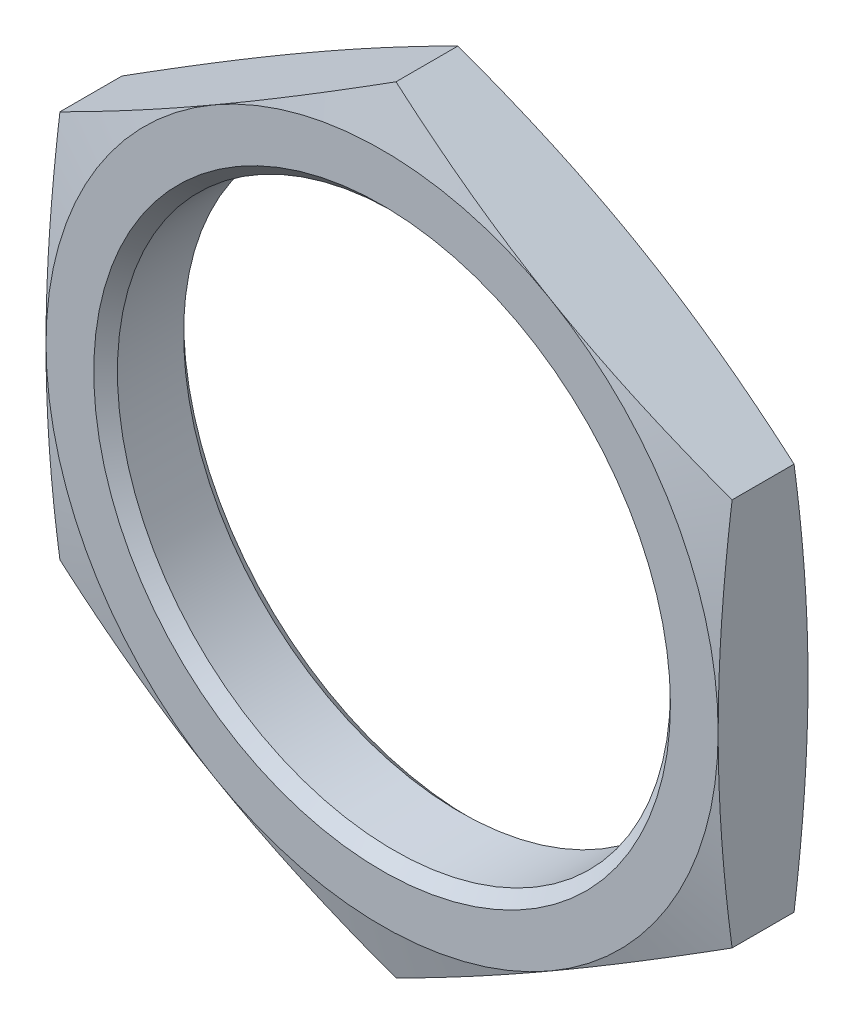
ISO-10303-21;
HEADER;
FILE_DESCRIPTION(('STEP AP214'),'2;1');
FILE_NAME('part.step','',(''),(''),'','','');
FILE_SCHEMA(('AUTOMOTIVE_DESIGN { 1 0 10303 214 1 1 1 1 }'));
ENDSEC;
DATA;
#1=APPLICATION_CONTEXT('core data for automotive mechanical design processes');
#2=APPLICATION_PROTOCOL_DEFINITION('international standard','automotive_design',2000,#1);
#3=PRODUCT_CONTEXT('',#1,'mechanical');
#4=PRODUCT('Part','Part','',(#3));
#5=PRODUCT_RELATED_PRODUCT_CATEGORY('part','',(#4));
#6=PRODUCT_DEFINITION_FORMATION('','',#4);
#7=PRODUCT_DEFINITION_CONTEXT('part definition',#1,'design');
#8=PRODUCT_DEFINITION('design','',#6,#7);
#9=PRODUCT_DEFINITION_SHAPE('','',#8);
#10=(LENGTH_UNIT() NAMED_UNIT(*) SI_UNIT(.MILLI.,.METRE.));
#11=(NAMED_UNIT(*) PLANE_ANGLE_UNIT() SI_UNIT($,.RADIAN.));
#12=(NAMED_UNIT(*) SI_UNIT($,.STERADIAN.) SOLID_ANGLE_UNIT());
#13=UNCERTAINTY_MEASURE_WITH_UNIT(LENGTH_MEASURE(1.E-05),#10,'distance_accuracy_value','');
#14=(GEOMETRIC_REPRESENTATION_CONTEXT(3) GLOBAL_UNCERTAINTY_ASSIGNED_CONTEXT((#13)) GLOBAL_UNIT_ASSIGNED_CONTEXT((#10,
#11,#12)) REPRESENTATION_CONTEXT('',''));
#15=CARTESIAN_POINT('',(0.,0.,0.));
#16=DIRECTION('',(0.,0.,1.));
#17=DIRECTION('',(1.,0.,0.));
#18=AXIS2_PLACEMENT_3D('',#15,#16,#17);
#19=CARTESIAN_POINT('',(0.,0.,-0.95));
#20=DIRECTION('',(0.,0.,-1.));
#21=DIRECTION('',(0.,-1.,0.));
#22=AXIS2_PLACEMENT_3D('',#19,#20,#21);
#23=PLANE('',#22);
#24=CARTESIAN_POINT('',(0.,0.,-0.95));
#25=DIRECTION('',(0.,0.,-1.));
#26=DIRECTION('',(1.,0.,0.));
#27=AXIS2_PLACEMENT_3D('',#24,#25,#26);
#28=CIRCLE('',#27,7.11);
#29=CARTESIAN_POINT('',(7.11,0.,-0.95));
#30=VERTEX_POINT('',#29);
#31=CARTESIAN_POINT('',(3.555,-6.157440620907,-0.95));
#32=VERTEX_POINT('',#31);
#33=EDGE_CURVE('E397',#30,#32,#28,.T.);
#34=ORIENTED_EDGE('',*,*,#33,.T.);
#35=CARTESIAN_POINT('',(0.,0.,-0.95));
#36=DIRECTION('',(0.,0.,-1.));
#37=DIRECTION('',(1.,0.,0.));
#38=AXIS2_PLACEMENT_3D('',#35,#36,#37);
#39=CIRCLE('',#38,7.11);
#40=CARTESIAN_POINT('',(-3.555,-6.157440620907,-0.95));
#41=VERTEX_POINT('',#40);
#42=EDGE_CURVE('E445',#32,#41,#39,.T.);
#43=ORIENTED_EDGE('',*,*,#42,.T.);
#44=CARTESIAN_POINT('',(0.,0.,-0.95));
#45=DIRECTION('',(0.,0.,-1.));
#46=DIRECTION('',(1.,0.,0.));
#47=AXIS2_PLACEMENT_3D('',#44,#45,#46);
#48=CIRCLE('',#47,7.11);
#49=CARTESIAN_POINT('',(-7.11,2.06476548E-07,-0.95));
#50=VERTEX_POINT('',#49);
#51=EDGE_CURVE('E449',#41,#50,#48,.T.);
#52=ORIENTED_EDGE('',*,*,#51,.T.);
#53=CARTESIAN_POINT('',(0.,0.,-0.95));
#54=DIRECTION('',(0.,0.,-1.));
#55=DIRECTION('',(1.,0.,0.));
#56=AXIS2_PLACEMENT_3D('',#53,#54,#55);
#57=CIRCLE('',#56,7.11);
#58=CARTESIAN_POINT('',(-3.555,6.157440620907,-0.95));
#59=VERTEX_POINT('',#58);
#60=EDGE_CURVE('E25',#50,#59,#57,.T.);
#61=ORIENTED_EDGE('',*,*,#60,.T.);
#62=CARTESIAN_POINT('',(0.,0.,-0.95));
#63=DIRECTION('',(0.,0.,-1.));
#64=DIRECTION('',(1.,0.,0.));
#65=AXIS2_PLACEMENT_3D('',#62,#63,#64);
#66=CIRCLE('',#65,7.11);
#67=CARTESIAN_POINT('',(3.555,6.157440620907,-0.95));
#68=VERTEX_POINT('',#67);
#69=EDGE_CURVE('E11',#59,#68,#66,.T.);
#70=ORIENTED_EDGE('',*,*,#69,.T.);
#71=CARTESIAN_POINT('',(0.,0.,-0.95));
#72=DIRECTION('',(0.,0.,-1.));
#73=DIRECTION('',(1.,0.,0.));
#74=AXIS2_PLACEMENT_3D('',#71,#72,#73);
#75=CIRCLE('',#74,7.11);
#76=EDGE_CURVE('E391',#68,#30,#75,.T.);
#77=ORIENTED_EDGE('',*,*,#76,.T.);
#78=EDGE_LOOP('',(#34,#43,#52,#61,#70,#77));
#79=FACE_BOUND('',#78,.T.);
#80=CARTESIAN_POINT('',(0.,0.,-0.95));
#81=DIRECTION('',(0.,0.,-1.));
#82=DIRECTION('',(1.,0.,0.));
#83=AXIS2_PLACEMENT_3D('',#80,#81,#82);
#84=CIRCLE('',#83,6.1);
#85=CARTESIAN_POINT('',(6.1,0.,-0.95));
#86=VERTEX_POINT('',#85);
#87=EDGE_CURVE('E331',#86,#86,#84,.T.);
#88=ORIENTED_EDGE('',*,*,#87,.F.);
#89=EDGE_LOOP('',(#88));
#90=FACE_BOUND('',#89,.T.);
#91=ADVANCED_FACE('F17',(#79,#90),#23,.T.);
#92=CARTESIAN_POINT('',(0.,0.,0.));
#93=DIRECTION('',(0.,0.,1.));
#94=DIRECTION('',(1.,0.,0.));
#95=AXIS2_PLACEMENT_3D('',#92,#93,#94);
#96=CONICAL_SURFACE('',#95,10.655448267188,1.308996938996);
#97=CARTESIAN_POINT('',(5.95523630408934E-13,8.20992082787682,-0.655277102432029));
#98=CARTESIAN_POINT('',(1.90511875818563,7.10999999999992,-0.95));
#99=CARTESIAN_POINT('',(3.555,6.157440620907,-0.95));
#100=(BOUNDED_CURVE() B_SPLINE_CURVE(2,(#97,#98,#99),.UNSPECIFIED.,.F.,
.F.) B_SPLINE_CURVE_WITH_KNOTS((3,3),(0.,1.),
.UNSPECIFIED.) CURVE() GEOMETRIC_REPRESENTATION_ITEM() RATIONAL_B_SPLINE_CURVE((1.,
1.03795484930204,1.)) REPRESENTATION_ITEM(''));
#101=CARTESIAN_POINT('',(0.,8.209920827876,-0.655277102432));
#102=VERTEX_POINT('',#101);
#103=EDGE_CURVE('E334',#102,#68,#100,.T.);
#104=ORIENTED_EDGE('',*,*,#103,.T.);
#105=ORIENTED_EDGE('',*,*,#69,.F.);
#106=CARTESIAN_POINT('',(-3.555,6.157440620907,-0.95));
#107=CARTESIAN_POINT('',(-1.90511875818559,7.10999999999996,-0.95));
#108=CARTESIAN_POINT('',(-4.71178651650916E-13,8.20992082787689,-0.655277102432009));
#109=(BOUNDED_CURVE() B_SPLINE_CURVE(2,(#106,#107,#108),.UNSPECIFIED.,.F.,
.F.) B_SPLINE_CURVE_WITH_KNOTS((3,3),(0.,1.),
.UNSPECIFIED.) CURVE() GEOMETRIC_REPRESENTATION_ITEM() RATIONAL_B_SPLINE_CURVE((1.,
1.03795484930206,1.)) REPRESENTATION_ITEM(''));
#110=EDGE_CURVE('E206',#59,#102,#109,.T.);
#111=ORIENTED_EDGE('',*,*,#110,.T.);
#112=EDGE_LOOP('',(#104,#105,#111));
#113=FACE_BOUND('',#112,.T.);
#114=ADVANCED_FACE('F463',(#113),#96,.T.);
#115=CARTESIAN_POINT('',(0.,0.,0.));
#116=DIRECTION('',(0.,0.,1.));
#117=DIRECTION('',(1.,0.,0.));
#118=AXIS2_PLACEMENT_3D('',#115,#116,#117);
#119=CONICAL_SURFACE('',#118,10.655448267188,1.308996938996);
#120=CARTESIAN_POINT('',(-7.10999999999942,4.10496041393718,-0.655277102432026));
#121=CARTESIAN_POINT('',(-5.20488124181438,5.20488124181408,-0.950000000000001));
#122=CARTESIAN_POINT('',(-3.555,6.157440620907,-0.95));
#123=(BOUNDED_CURVE() B_SPLINE_CURVE(2,(#120,#121,#122),.UNSPECIFIED.,.F.,
.F.) B_SPLINE_CURVE_WITH_KNOTS((3,3),(0.,1.),
.UNSPECIFIED.) CURVE() GEOMETRIC_REPRESENTATION_ITEM() RATIONAL_B_SPLINE_CURVE((1.,
1.03795484930208,1.)) REPRESENTATION_ITEM(''));
#124=CARTESIAN_POINT('',(-7.11,4.104960413938,-0.655277102432));
#125=VERTEX_POINT('',#124);
#126=EDGE_CURVE('E259',#125,#59,#123,.T.);
#127=ORIENTED_EDGE('',*,*,#126,.T.);
#128=ORIENTED_EDGE('',*,*,#60,.F.);
#129=CARTESIAN_POINT('',(-7.11,2.06476544361227E-07,-0.95));
#130=CARTESIAN_POINT('',(-7.11,1.90511886883588,-0.949999985175651));
#131=CARTESIAN_POINT('',(-7.11,4.10496041393862,-0.655277102432165));
#132=(BOUNDED_CURVE() B_SPLINE_CURVE(2,(#129,#130,#131),.UNSPECIFIED.,.F.,
.F.) B_SPLINE_CURVE_WITH_KNOTS((3,3),(0.,1.),
.UNSPECIFIED.) CURVE() GEOMETRIC_REPRESENTATION_ITEM() RATIONAL_B_SPLINE_CURVE((1.,
1.03795484526372,1.)) REPRESENTATION_ITEM(''));
#133=EDGE_CURVE('E240',#50,#125,#132,.T.);
#134=ORIENTED_EDGE('',*,*,#133,.T.);
#135=EDGE_LOOP('',(#127,#128,#134));
#136=FACE_BOUND('',#135,.T.);
#137=ADVANCED_FACE('F457',(#136),#119,.T.);
#138=CARTESIAN_POINT('',(0.,0.,0.));
#139=DIRECTION('',(0.,0.,1.));
#140=DIRECTION('',(1.,0.,0.));
#141=AXIS2_PLACEMENT_3D('',#138,#139,#140);
#142=CONICAL_SURFACE('',#141,10.655448267188,1.308996938996);
#143=ORIENTED_EDGE('',*,*,#51,.F.);
#144=CARTESIAN_POINT('',(-3.555,-6.157440620907,-0.95));
#145=CARTESIAN_POINT('',(-5.20488124181442,-5.20488124181405,-0.950000000000001));
#146=CARTESIAN_POINT('',(-7.10999999999953,-4.10496041393711,-0.655277102432009));
#147=(BOUNDED_CURVE() B_SPLINE_CURVE(2,(#144,#145,#146),.UNSPECIFIED.,.F.,
.F.) B_SPLINE_CURVE_WITH_KNOTS((3,3),(0.,1.),
.UNSPECIFIED.) CURVE() GEOMETRIC_REPRESENTATION_ITEM() RATIONAL_B_SPLINE_CURVE((1.,
1.03795484930205,1.)) REPRESENTATION_ITEM(''));
#148=CARTESIAN_POINT('',(-7.11,-4.104960413938,-0.655277102432));
#149=VERTEX_POINT('',#148);
#150=EDGE_CURVE('E384',#41,#149,#147,.T.);
#151=ORIENTED_EDGE('',*,*,#150,.T.);
#152=CARTESIAN_POINT('',(-7.11,-4.10496041393616,-0.655277102432491));
#153=CARTESIAN_POINT('',(-7.11,-1.905118647534,-0.950000014824347));
#154=CARTESIAN_POINT('',(-7.11,2.06476544361227E-07,-0.95));
#155=(BOUNDED_CURVE() B_SPLINE_CURVE(2,(#152,#153,#154),.UNSPECIFIED.,.F.,
.F.) B_SPLINE_CURVE_WITH_KNOTS((3,3),(0.,1.),
.UNSPECIFIED.) CURVE() GEOMETRIC_REPRESENTATION_ITEM() RATIONAL_B_SPLINE_CURVE((1.,
1.03795485334035,1.)) REPRESENTATION_ITEM(''));
#156=EDGE_CURVE('E207',#149,#50,#155,.T.);
#157=ORIENTED_EDGE('',*,*,#156,.T.);
#158=EDGE_LOOP('',(#143,#151,#157));
#159=FACE_BOUND('',#158,.T.);
#160=ADVANCED_FACE('F482',(#159),#142,.T.);
#161=CARTESIAN_POINT('',(0.,0.,0.));
#162=DIRECTION('',(0.,0.,1.));
#163=DIRECTION('',(1.,0.,0.));
#164=AXIS2_PLACEMENT_3D('',#161,#162,#163);
#165=CONICAL_SURFACE('',#164,10.655448267188,1.308996938996);
#166=ORIENTED_EDGE('',*,*,#42,.F.);
#167=CARTESIAN_POINT('',(3.555,-6.157440620907,-0.95));
#168=CARTESIAN_POINT('',(1.90511875818559,-7.10999999999995,-0.95));
#169=CARTESIAN_POINT('',(4.73843186910017E-13,-8.20992082787689,-0.655277102432009));
#170=(BOUNDED_CURVE() B_SPLINE_CURVE(2,(#167,#168,#169),.UNSPECIFIED.,.F.,
.F.) B_SPLINE_CURVE_WITH_KNOTS((3,3),(0.,1.),
.UNSPECIFIED.) CURVE() GEOMETRIC_REPRESENTATION_ITEM() RATIONAL_B_SPLINE_CURVE((1.,
1.03795484930205,1.)) REPRESENTATION_ITEM(''));
#171=CARTESIAN_POINT('',(0.,-8.209920827876,-0.655277102432));
#172=VERTEX_POINT('',#171);
#173=EDGE_CURVE('E362',#32,#172,#170,.T.);
#174=ORIENTED_EDGE('',*,*,#173,.T.);
#175=CARTESIAN_POINT('',(-5.87974113841483E-13,-8.20992082787682,-0.655277102432026));
#176=CARTESIAN_POINT('',(-1.90511875818563,-7.10999999999993,-0.950000000000001));
#177=CARTESIAN_POINT('',(-3.555,-6.157440620907,-0.95));
#178=(BOUNDED_CURVE() B_SPLINE_CURVE(2,(#175,#176,#177),.UNSPECIFIED.,.F.,
.F.) B_SPLINE_CURVE_WITH_KNOTS((3,3),(0.,1.),
.UNSPECIFIED.) CURVE() GEOMETRIC_REPRESENTATION_ITEM() RATIONAL_B_SPLINE_CURVE((1.,
1.03795484930208,1.)) REPRESENTATION_ITEM(''));
#179=EDGE_CURVE('E390',#172,#41,#178,.T.);
#180=ORIENTED_EDGE('',*,*,#179,.T.);
#181=EDGE_LOOP('',(#166,#174,#180));
#182=FACE_BOUND('',#181,.T.);
#183=ADVANCED_FACE('F476',(#182),#165,.T.);
#184=CARTESIAN_POINT('',(0.,0.,0.));
#185=DIRECTION('',(0.,0.,1.));
#186=DIRECTION('',(1.,0.,0.));
#187=AXIS2_PLACEMENT_3D('',#184,#185,#186);
#188=CONICAL_SURFACE('',#187,10.655448267188,1.308996938996);
#189=ORIENTED_EDGE('',*,*,#33,.F.);
#190=CARTESIAN_POINT('',(7.11,0.,-0.95));
#191=CARTESIAN_POINT('',(7.11000000000001,-1.90511875818543,-0.95));
#192=CARTESIAN_POINT('',(7.11,-4.10496041393861,-0.655277102432164));
#193=(BOUNDED_CURVE() B_SPLINE_CURVE(2,(#190,#191,#192),.UNSPECIFIED.,.F.,
.F.) B_SPLINE_CURVE_WITH_KNOTS((3,3),(0.,1.),
.UNSPECIFIED.) CURVE() GEOMETRIC_REPRESENTATION_ITEM() RATIONAL_B_SPLINE_CURVE((1.,
1.03795484930205,1.)) REPRESENTATION_ITEM(''));
#194=CARTESIAN_POINT('',(7.11,-4.104960413938,-0.655277102432));
#195=VERTEX_POINT('',#194);
#196=EDGE_CURVE('E337',#30,#195,#193,.T.);
#197=ORIENTED_EDGE('',*,*,#196,.T.);
#198=CARTESIAN_POINT('',(7.10999999999941,-4.10496041393718,-0.655277102432028));
#199=CARTESIAN_POINT('',(5.20488124181437,-5.20488124181408,-0.95));
#200=CARTESIAN_POINT('',(3.555,-6.157440620907,-0.95));
#201=(BOUNDED_CURVE() B_SPLINE_CURVE(2,(#198,#199,#200),.UNSPECIFIED.,.F.,
.F.) B_SPLINE_CURVE_WITH_KNOTS((3,3),(0.,1.),
.UNSPECIFIED.) CURVE() GEOMETRIC_REPRESENTATION_ITEM() RATIONAL_B_SPLINE_CURVE((1.,
1.03795484930206,1.)) REPRESENTATION_ITEM(''));
#202=EDGE_CURVE('E368',#195,#32,#201,.T.);
#203=ORIENTED_EDGE('',*,*,#202,.T.);
#204=EDGE_LOOP('',(#189,#197,#203));
#205=FACE_BOUND('',#204,.T.);
#206=ADVANCED_FACE('F474',(#205),#188,.T.);
#207=CARTESIAN_POINT('',(0.,0.,0.));
#208=DIRECTION('',(0.,0.,1.));
#209=DIRECTION('',(1.,0.,0.));
#210=AXIS2_PLACEMENT_3D('',#207,#208,#209);
#211=CONICAL_SURFACE('',#210,10.655448267188,1.308996938996);
#212=CARTESIAN_POINT('',(7.11,4.10496041393615,-0.655277102432495));
#213=CARTESIAN_POINT('',(7.11,1.90511875818445,-0.950000000000001));
#214=CARTESIAN_POINT('',(7.11,0.,-0.95));
#215=(BOUNDED_CURVE() B_SPLINE_CURVE(2,(#212,#213,#214),.UNSPECIFIED.,.F.,
.F.) B_SPLINE_CURVE_WITH_KNOTS((3,3),(0.,1.),
.UNSPECIFIED.) CURVE() GEOMETRIC_REPRESENTATION_ITEM() RATIONAL_B_SPLINE_CURVE((1.,
1.03795484930199,1.)) REPRESENTATION_ITEM(''));
#216=CARTESIAN_POINT('',(7.11,4.104960413938,-0.655277102432));
#217=VERTEX_POINT('',#216);
#218=EDGE_CURVE('E343',#217,#30,#215,.T.);
#219=ORIENTED_EDGE('',*,*,#218,.T.);
#220=ORIENTED_EDGE('',*,*,#76,.F.);
#221=CARTESIAN_POINT('',(3.555,6.157440620907,-0.95));
#222=CARTESIAN_POINT('',(5.20488124181442,5.20488124181405,-0.95));
#223=CARTESIAN_POINT('',(7.10999999999953,4.10496041393711,-0.655277102432009));
#224=(BOUNDED_CURVE() B_SPLINE_CURVE(2,(#221,#222,#223),.UNSPECIFIED.,.F.,
.F.) B_SPLINE_CURVE_WITH_KNOTS((3,3),(0.,1.),
.UNSPECIFIED.) CURVE() GEOMETRIC_REPRESENTATION_ITEM() RATIONAL_B_SPLINE_CURVE((1.,
1.03795484930206,1.)) REPRESENTATION_ITEM(''));
#225=EDGE_CURVE('E268',#68,#217,#224,.T.);
#226=ORIENTED_EDGE('',*,*,#225,.T.);
#227=EDGE_LOOP('',(#219,#220,#226));
#228=FACE_BOUND('',#227,.T.);
#229=ADVANCED_FACE('F470',(#228),#211,.T.);
#230=CARTESIAN_POINT('',(0.,0.,-0.7));
#231=DIRECTION('',(0.,0.,-1.));
#232=DIRECTION('',(1.,0.,0.));
#233=AXIS2_PLACEMENT_3D('',#230,#231,#232);
#234=CONICAL_SURFACE('',#233,5.85,0.785398163397);
#235=ORIENTED_EDGE('',*,*,#87,.T.);
#236=DIRECTION('',(0.707106781186548,0.,-0.707106781186548));
#237=VECTOR('',#236,1.);
#238=CARTESIAN_POINT('',(5.85,0.,-0.7));
#239=LINE('',#238,#237);
#240=CARTESIAN_POINT('',(5.85,0.,-0.7));
#241=VERTEX_POINT('',#240);
#242=EDGE_CURVE('E37',#241,#86,#239,.T.);
#243=ORIENTED_EDGE('',*,*,#242,.F.);
#244=CARTESIAN_POINT('',(0.,0.,-0.7));
#245=DIRECTION('',(0.,0.,-1.));
#246=DIRECTION('',(1.,0.,0.));
#247=AXIS2_PLACEMENT_3D('',#244,#245,#246);
#248=CIRCLE('',#247,5.85);
#249=EDGE_CURVE('E327',#241,#241,#248,.T.);
#250=ORIENTED_EDGE('',*,*,#249,.F.);
#251=ORIENTED_EDGE('',*,*,#242,.T.);
#252=EDGE_LOOP('',(#235,#243,#250,#251));
#253=FACE_BOUND('',#252,.T.);
#254=ADVANCED_FACE('F535',(#253),#234,.F.);
#255=CARTESIAN_POINT('',(7.11,4.104960413938,0.95));
#256=DIRECTION('',(0.50000000000019,0.866025403784329,0.));
#257=DIRECTION('',(0.,0.,-1.));
#258=AXIS2_PLACEMENT_3D('',#255,#256,#257);
#259=PLANE('',#258);
#260=CARTESIAN_POINT('',(7.10999999999941,4.10496041393718,0.655277102432028));
#261=CARTESIAN_POINT('',(5.20488124959185,5.20488123732375,0.94999999879682));
#262=CARTESIAN_POINT('',(3.55500001451297,6.15744061252794,0.95));
#263=(BOUNDED_CURVE() B_SPLINE_CURVE(2,(#260,#261,#262),.UNSPECIFIED.,.F.,
.F.) B_SPLINE_CURVE_WITH_KNOTS((3,3),(0.,1.),
.UNSPECIFIED.) CURVE() GEOMETRIC_REPRESENTATION_ITEM() RATIONAL_B_SPLINE_CURVE((1.,
1.03795484897429,1.)) REPRESENTATION_ITEM(''));
#264=CARTESIAN_POINT('',(7.11,4.104960413938,0.655277102432));
#265=VERTEX_POINT('',#264);
#266=CARTESIAN_POINT('',(3.555000014513,6.157440612528,0.95));
#267=VERTEX_POINT('',#266);
#268=EDGE_CURVE('E313',#265,#267,#263,.T.);
#269=ORIENTED_EDGE('',*,*,#268,.F.);
#270=DIRECTION('',(0.,0.,-1.));
#271=VECTOR('',#270,1.);
#272=CARTESIAN_POINT('',(7.11,4.104960413938,0.95));
#273=LINE('',#272,#271);
#274=EDGE_CURVE('E352',#265,#217,#273,.T.);
#275=ORIENTED_EDGE('',*,*,#274,.T.);
#276=ORIENTED_EDGE('',*,*,#225,.F.);
#277=ORIENTED_EDGE('',*,*,#103,.F.);
#278=DIRECTION('',(0.,0.,-1.));
#279=VECTOR('',#278,1.);
#280=CARTESIAN_POINT('',(0.,8.209920827876,0.95));
#281=LINE('',#280,#279);
#282=CARTESIAN_POINT('',(0.,8.209920827876,0.655277102432));
#283=VERTEX_POINT('',#282);
#284=EDGE_CURVE('E204',#283,#102,#281,.T.);
#285=ORIENTED_EDGE('',*,*,#284,.F.);
#286=CARTESIAN_POINT('',(3.55500001451297,6.15744061252794,0.95));
#287=CARTESIAN_POINT('',(1.90511876596306,7.10999999550963,0.95000000120318));
#288=CARTESIAN_POINT('',(4.76063632959267E-13,8.20992082787688,0.655277102432009));
#289=(BOUNDED_CURVE() B_SPLINE_CURVE(2,(#286,#287,#288),.UNSPECIFIED.,.F.,
.F.) B_SPLINE_CURVE_WITH_KNOTS((3,3),(0.,1.),
.UNSPECIFIED.) CURVE() GEOMETRIC_REPRESENTATION_ITEM() RATIONAL_B_SPLINE_CURVE((1.,
1.03795484962984,1.)) REPRESENTATION_ITEM(''));
#290=EDGE_CURVE('E294',#267,#283,#289,.T.);
#291=ORIENTED_EDGE('',*,*,#290,.F.);
#292=EDGE_LOOP('',(#269,#275,#276,#277,#285,#291));
#293=FACE_BOUND('',#292,.T.);
#294=ADVANCED_FACE('F467',(#293),#259,.T.);
#295=CARTESIAN_POINT('',(0.,8.209920827876,0.95));
#296=DIRECTION('',(-0.50000000000019,0.866025403784329,0.));
#297=DIRECTION('',(0.,0.,1.));
#298=AXIS2_PLACEMENT_3D('',#295,#296,#297);
#299=PLANE('',#298);
#300=CARTESIAN_POINT('',(-5.83533221742982E-13,8.20992082787682,0.655277102432025));
#301=CARTESIAN_POINT('',(-1.90511875962655,7.10999999916801,0.95000000022291));
#302=CARTESIAN_POINT('',(-3.55500000268878,6.15744061935463,0.95));
#303=(BOUNDED_CURVE() B_SPLINE_CURVE(2,(#300,#301,#302),.UNSPECIFIED.,.F.,
.F.) B_SPLINE_CURVE_WITH_KNOTS((3,3),(0.,1.),
.UNSPECIFIED.) CURVE() GEOMETRIC_REPRESENTATION_ITEM() RATIONAL_B_SPLINE_CURVE((1.,
1.03795484936281,1.)) REPRESENTATION_ITEM(''));
#304=CARTESIAN_POINT('',(-3.555000002689,6.157440619355,0.95));
#305=VERTEX_POINT('',#304);
#306=EDGE_CURVE('E303',#283,#305,#303,.T.);
#307=ORIENTED_EDGE('',*,*,#306,.F.);
#308=ORIENTED_EDGE('',*,*,#284,.T.);
#309=ORIENTED_EDGE('',*,*,#110,.F.);
#310=ORIENTED_EDGE('',*,*,#126,.F.);
#311=DIRECTION('',(0.,0.,-1.));
#312=VECTOR('',#311,1.);
#313=CARTESIAN_POINT('',(-7.11,4.104960413938,0.95));
#314=LINE('',#313,#312);
#315=CARTESIAN_POINT('',(-7.11,4.104960413938,0.655277102432));
#316=VERTEX_POINT('',#315);
#317=EDGE_CURVE('E246',#316,#125,#314,.T.);
#318=ORIENTED_EDGE('',*,*,#317,.F.);
#319=CARTESIAN_POINT('',(-3.55500000268878,6.15744061935463,0.95));
#320=CARTESIAN_POINT('',(-5.20488124325534,5.20488124098214,0.94999999977709));
#321=CARTESIAN_POINT('',(-7.10999999999953,4.10496041393711,0.655277102432009));
#322=(BOUNDED_CURVE() B_SPLINE_CURVE(2,(#319,#320,#321),.UNSPECIFIED.,.F.,
.F.) B_SPLINE_CURVE_WITH_KNOTS((3,3),(0.,1.),
.UNSPECIFIED.) CURVE() GEOMETRIC_REPRESENTATION_ITEM() RATIONAL_B_SPLINE_CURVE((1.,
1.03795484924133,1.)) REPRESENTATION_ITEM(''));
#323=EDGE_CURVE('E277',#305,#316,#322,.T.);
#324=ORIENTED_EDGE('',*,*,#323,.F.);
#325=EDGE_LOOP('',(#307,#308,#309,#310,#318,#324));
#326=FACE_BOUND('',#325,.T.);
#327=ADVANCED_FACE('F461',(#326),#299,.T.);
#328=CARTESIAN_POINT('',(-7.11,4.104960413938,0.95));
#329=DIRECTION('',(-1.,0.,0.));
#330=DIRECTION('',(0.,0.,1.));
#331=AXIS2_PLACEMENT_3D('',#328,#329,#330);
#332=PLANE('',#331);
#333=CARTESIAN_POINT('',(-7.11,4.10496041393616,0.655277102432492));
#334=CARTESIAN_POINT('',(-7.11,1.90511876550157,0.949999999019692));
#335=CARTESIAN_POINT('',(-7.11,1.36539222875836E-08,0.95));
#336=(BOUNDED_CURVE() B_SPLINE_CURVE(2,(#333,#334,#335),.UNSPECIFIED.,.F.,
.F.) B_SPLINE_CURVE_WITH_KNOTS((3,3),(0.,1.),
.UNSPECIFIED.) CURVE() GEOMETRIC_REPRESENTATION_ITEM() RATIONAL_B_SPLINE_CURVE((1.,
1.03795484903495,1.)) REPRESENTATION_ITEM(''));
#337=CARTESIAN_POINT('',(-7.11,1.3653922E-08,0.95));
#338=VERTEX_POINT('',#337);
#339=EDGE_CURVE('E286',#316,#338,#336,.T.);
#340=ORIENTED_EDGE('',*,*,#339,.F.);
#341=ORIENTED_EDGE('',*,*,#317,.T.);
#342=ORIENTED_EDGE('',*,*,#133,.F.);
#343=ORIENTED_EDGE('',*,*,#156,.F.);
#344=DIRECTION('',(0.,0.,-1.));
#345=VECTOR('',#344,1.);
#346=CARTESIAN_POINT('',(-7.11,-4.104960413938,0.95));
#347=LINE('',#346,#345);
#348=CARTESIAN_POINT('',(-7.11,-4.104960413938,0.655277102432));
#349=VERTEX_POINT('',#348);
#350=EDGE_CURVE('E377',#349,#149,#347,.T.);
#351=ORIENTED_EDGE('',*,*,#350,.F.);
#352=CARTESIAN_POINT('',(-7.11,1.36539222875836E-08,0.95));
#353=CARTESIAN_POINT('',(-7.11,-1.90511875086832,0.950000000980308));
#354=CARTESIAN_POINT('',(-7.11,-4.10496041393862,0.655277102432165));
#355=(BOUNDED_CURVE() B_SPLINE_CURVE(2,(#352,#353,#354),.UNSPECIFIED.,.F.,
.F.) B_SPLINE_CURVE_WITH_KNOTS((3,3),(0.,1.),
.UNSPECIFIED.) CURVE() GEOMETRIC_REPRESENTATION_ITEM() RATIONAL_B_SPLINE_CURVE((1.,
1.03795484956909,1.)) REPRESENTATION_ITEM(''));
#356=EDGE_CURVE('E214',#338,#349,#355,.T.);
#357=ORIENTED_EDGE('',*,*,#356,.F.);
#358=EDGE_LOOP('',(#340,#341,#342,#343,#351,#357));
#359=FACE_BOUND('',#358,.T.);
#360=ADVANCED_FACE('F485',(#359),#332,.T.);
#361=CARTESIAN_POINT('',(-7.11,-4.104960413938,0.95));
#362=DIRECTION('',(-0.50000000000019,-0.866025403784329,0.));
#363=DIRECTION('',(-0.866025403784329,0.50000000000019,0.));
#364=AXIS2_PLACEMENT_3D('',#361,#362,#363);
#365=PLANE('',#364);
#366=CARTESIAN_POINT('',(-7.10999999999942,-4.10496041393718,0.655277102432026));
#367=CARTESIAN_POINT('',(-5.20488124327462,-5.204881240971,0.949999999774097));
#368=CARTESIAN_POINT('',(-3.55500000272488,-6.15744061933379,0.95));
#369=(BOUNDED_CURVE() B_SPLINE_CURVE(2,(#366,#367,#368),.UNSPECIFIED.,.F.,
.F.) B_SPLINE_CURVE_WITH_KNOTS((3,3),(0.,1.),
.UNSPECIFIED.) CURVE() GEOMETRIC_REPRESENTATION_ITEM() RATIONAL_B_SPLINE_CURVE((1.,
1.03795484924055,1.)) REPRESENTATION_ITEM(''));
#370=CARTESIAN_POINT('',(-3.555000002725,-6.157440619334,0.95));
#371=VERTEX_POINT('',#370);
#372=EDGE_CURVE('E209',#349,#371,#369,.T.);
#373=ORIENTED_EDGE('',*,*,#372,.F.);
#374=ORIENTED_EDGE('',*,*,#350,.T.);
#375=ORIENTED_EDGE('',*,*,#150,.F.);
#376=ORIENTED_EDGE('',*,*,#179,.F.);
#377=DIRECTION('',(0.,0.,-1.));
#378=VECTOR('',#377,1.);
#379=CARTESIAN_POINT('',(0.,-8.209920827876,0.95));
#380=LINE('',#379,#378);
#381=CARTESIAN_POINT('',(0.,-8.209920827876,0.655277102432));
#382=VERTEX_POINT('',#381);
#383=EDGE_CURVE('E359',#382,#172,#380,.T.);
#384=ORIENTED_EDGE('',*,*,#383,.F.);
#385=CARTESIAN_POINT('',(-3.55500000272488,-6.15744061933379,0.95));
#386=CARTESIAN_POINT('',(-1.90511875964584,-7.10999999915686,0.950000000225903));
#387=CARTESIAN_POINT('',(-4.72066830070617E-13,-8.20992082787689,0.655277102432009));
#388=(BOUNDED_CURVE() B_SPLINE_CURVE(2,(#385,#386,#387),.UNSPECIFIED.,.F.,
.F.) B_SPLINE_CURVE_WITH_KNOTS((3,3),(0.,1.),
.UNSPECIFIED.) CURVE() GEOMETRIC_REPRESENTATION_ITEM() RATIONAL_B_SPLINE_CURVE((1.,
1.0379548493636,1.)) REPRESENTATION_ITEM(''));
#389=EDGE_CURVE('E159',#371,#382,#388,.T.);
#390=ORIENTED_EDGE('',*,*,#389,.F.);
#391=EDGE_LOOP('',(#373,#374,#375,#376,#384,#390));
#392=FACE_BOUND('',#391,.T.);
#393=ADVANCED_FACE('F480',(#392),#365,.T.);
#394=CARTESIAN_POINT('',(0.,-8.209920827876,0.95));
#395=DIRECTION('',(0.50000000000019,-0.866025403784329,0.));
#396=DIRECTION('',(0.,0.,-1.));
#397=AXIS2_PLACEMENT_3D('',#394,#395,#396);
#398=PLANE('',#397);
#399=CARTESIAN_POINT('',(5.92859095149834E-13,-8.20992082787682,0.655277102432028));
#400=CARTESIAN_POINT('',(1.90511875870171,-7.10999999970198,0.950000000079838));
#401=CARTESIAN_POINT('',(3.555000000963,-6.15744062035101,0.95));
#402=(BOUNDED_CURVE() B_SPLINE_CURVE(2,(#399,#400,#401),.UNSPECIFIED.,.F.,
.F.) B_SPLINE_CURVE_WITH_KNOTS((3,3),(0.,1.),
.UNSPECIFIED.) CURVE() GEOMETRIC_REPRESENTATION_ITEM() RATIONAL_B_SPLINE_CURVE((1.,
1.03795484932379,1.)) REPRESENTATION_ITEM(''));
#403=CARTESIAN_POINT('',(3.555000000963,-6.157440620351,0.95));
#404=VERTEX_POINT('',#403);
#405=EDGE_CURVE('E152',#382,#404,#402,.T.);
#406=ORIENTED_EDGE('',*,*,#405,.F.);
#407=ORIENTED_EDGE('',*,*,#383,.T.);
#408=ORIENTED_EDGE('',*,*,#173,.F.);
#409=ORIENTED_EDGE('',*,*,#202,.F.);
#410=DIRECTION('',(0.,0.,-1.));
#411=VECTOR('',#410,1.);
#412=CARTESIAN_POINT('',(7.11,-4.104960413938,0.95));
#413=LINE('',#412,#411);
#414=CARTESIAN_POINT('',(7.11,-4.104960413938,0.655277102432));
#415=VERTEX_POINT('',#414);
#416=EDGE_CURVE('E168',#415,#195,#413,.T.);
#417=ORIENTED_EDGE('',*,*,#416,.F.);
#418=CARTESIAN_POINT('',(3.555000000963,-6.15744062035101,0.95));
#419=CARTESIAN_POINT('',(5.20488124233049,-5.2048812415161,0.949999999920163));
#420=CARTESIAN_POINT('',(7.10999999999953,-4.10496041393711,0.655277102432009));
#421=(BOUNDED_CURVE() B_SPLINE_CURVE(2,(#418,#419,#420),.UNSPECIFIED.,.F.,
.F.) B_SPLINE_CURVE_WITH_KNOTS((3,3),(0.,1.),
.UNSPECIFIED.) CURVE() GEOMETRIC_REPRESENTATION_ITEM() RATIONAL_B_SPLINE_CURVE((1.,
1.03795484928034,1.)) REPRESENTATION_ITEM(''));
#422=EDGE_CURVE('E163',#404,#415,#421,.T.);
#423=ORIENTED_EDGE('',*,*,#422,.F.);
#424=EDGE_LOOP('',(#406,#407,#408,#409,#417,#423));
#425=FACE_BOUND('',#424,.T.);
#426=ADVANCED_FACE('F166',(#425),#398,.T.);
#427=CARTESIAN_POINT('',(7.11,-4.104960413938,0.95));
#428=DIRECTION('',(1.,0.,0.));
#429=DIRECTION('',(0.,1.,0.));
#430=AXIS2_PLACEMENT_3D('',#427,#428,#429);
#431=PLANE('',#430);
#432=CARTESIAN_POINT('',(7.11,-4.10496041393615,0.655277102432494));
#433=CARTESIAN_POINT('',(7.11000000000001,-1.90511875818445,0.950000000000002));
#434=CARTESIAN_POINT('',(7.11,0.,0.95));
#435=(BOUNDED_CURVE() B_SPLINE_CURVE(2,(#432,#433,#434),.UNSPECIFIED.,.F.,
.F.) B_SPLINE_CURVE_WITH_KNOTS((3,3),(0.,1.),
.UNSPECIFIED.) CURVE() GEOMETRIC_REPRESENTATION_ITEM() RATIONAL_B_SPLINE_CURVE((1.,
1.03795484930201,1.)) REPRESENTATION_ITEM(''));
#436=CARTESIAN_POINT('',(7.11,0.,0.95));
#437=VERTEX_POINT('',#436);
#438=EDGE_CURVE('E174',#415,#437,#435,.T.);
#439=ORIENTED_EDGE('',*,*,#438,.F.);
#440=ORIENTED_EDGE('',*,*,#416,.T.);
#441=ORIENTED_EDGE('',*,*,#196,.F.);
#442=ORIENTED_EDGE('',*,*,#218,.F.);
#443=ORIENTED_EDGE('',*,*,#274,.F.);
#444=CARTESIAN_POINT('',(7.11,0.,0.95));
#445=CARTESIAN_POINT('',(7.11,1.90511875818543,0.949999999999999));
#446=CARTESIAN_POINT('',(7.11,4.10496041393861,0.655277102432164));
#447=(BOUNDED_CURVE() B_SPLINE_CURVE(2,(#444,#445,#446),.UNSPECIFIED.,.F.,
.F.) B_SPLINE_CURVE_WITH_KNOTS((3,3),(0.,1.),
.UNSPECIFIED.) CURVE() GEOMETRIC_REPRESENTATION_ITEM() RATIONAL_B_SPLINE_CURVE((1.,
1.03795484930205,1.)) REPRESENTATION_ITEM(''));
#448=EDGE_CURVE('E304',#437,#265,#447,.T.);
#449=ORIENTED_EDGE('',*,*,#448,.F.);
#450=EDGE_LOOP('',(#439,#440,#441,#442,#443,#449));
#451=FACE_BOUND('',#450,.T.);
#452=ADVANCED_FACE('F552',(#451),#431,.T.);
#453=CARTESIAN_POINT('',(0.,0.,-0.95));
#454=DIRECTION('',(0.,0.,1.));
#455=DIRECTION('',(1.,0.,0.));
#456=AXIS2_PLACEMENT_3D('',#453,#454,#455);
#457=CYLINDRICAL_SURFACE('',#456,5.85);
#458=DIRECTION('',(0.,0.,1.));
#459=VECTOR('',#458,1.);
#460=CARTESIAN_POINT('',(5.85,0.,-0.95));
#461=LINE('',#460,#459);
#462=CARTESIAN_POINT('',(5.85,0.,0.7));
#463=VERTEX_POINT('',#462);
#464=EDGE_CURVE('E321',#241,#463,#461,.T.);
#465=ORIENTED_EDGE('',*,*,#464,.F.);
#466=ORIENTED_EDGE('',*,*,#249,.T.);
#467=ORIENTED_EDGE('',*,*,#464,.T.);
#468=CARTESIAN_POINT('',(0.,0.,0.7));
#469=DIRECTION('',(0.,0.,-1.));
#470=DIRECTION('',(1.,0.,0.));
#471=AXIS2_PLACEMENT_3D('',#468,#469,#470);
#472=CIRCLE('',#471,5.85);
#473=EDGE_CURVE('E186',#463,#463,#472,.T.);
#474=ORIENTED_EDGE('',*,*,#473,.F.);
#475=EDGE_LOOP('',(#465,#466,#467,#474));
#476=FACE_BOUND('',#475,.T.);
#477=ADVANCED_FACE('F549',(#476),#457,.F.);
#478=CARTESIAN_POINT('',(0.,0.,0.95));
#479=DIRECTION('',(0.,0.,-1.));
#480=DIRECTION('',(1.,0.,0.));
#481=AXIS2_PLACEMENT_3D('',#478,#479,#480);
#482=CONICAL_SURFACE('',#481,7.11,1.308996938996);
#483=CARTESIAN_POINT('',(0.,0.,0.95));
#484=DIRECTION('',(0.,0.,-1.));
#485=DIRECTION('',(1.,0.,0.));
#486=AXIS2_PLACEMENT_3D('',#483,#484,#485);
#487=CIRCLE('',#486,7.11);
#488=EDGE_CURVE('E191',#267,#437,#487,.T.);
#489=ORIENTED_EDGE('',*,*,#488,.T.);
#490=ORIENTED_EDGE('',*,*,#448,.T.);
#491=ORIENTED_EDGE('',*,*,#268,.T.);
#492=EDGE_LOOP('',(#489,#490,#491));
#493=FACE_BOUND('',#492,.T.);
#494=ADVANCED_FACE('F548',(#493),#482,.T.);
#495=CARTESIAN_POINT('',(0.,0.,0.95));
#496=DIRECTION('',(0.,0.,-1.));
#497=DIRECTION('',(1.,0.,0.));
#498=AXIS2_PLACEMENT_3D('',#495,#496,#497);
#499=CONICAL_SURFACE('',#498,7.11,1.308996938996);
#500=CARTESIAN_POINT('',(0.,0.,0.95));
#501=DIRECTION('',(0.,0.,-1.));
#502=DIRECTION('',(1.,0.,0.));
#503=AXIS2_PLACEMENT_3D('',#500,#501,#502);
#504=CIRCLE('',#503,7.11);
#505=EDGE_CURVE('E198',#305,#267,#504,.T.);
#506=ORIENTED_EDGE('',*,*,#505,.T.);
#507=ORIENTED_EDGE('',*,*,#290,.T.);
#508=ORIENTED_EDGE('',*,*,#306,.T.);
#509=EDGE_LOOP('',(#506,#507,#508));
#510=FACE_BOUND('',#509,.T.);
#511=ADVANCED_FACE('F494',(#510),#499,.T.);
#512=CARTESIAN_POINT('',(0.,0.,0.95));
#513=DIRECTION('',(0.,0.,-1.));
#514=DIRECTION('',(1.,0.,0.));
#515=AXIS2_PLACEMENT_3D('',#512,#513,#514);
#516=CONICAL_SURFACE('',#515,7.11,1.308996938996);
#517=CARTESIAN_POINT('',(0.,0.,0.95));
#518=DIRECTION('',(0.,0.,-1.));
#519=DIRECTION('',(1.,0.,0.));
#520=AXIS2_PLACEMENT_3D('',#517,#518,#519);
#521=CIRCLE('',#520,7.11);
#522=EDGE_CURVE('E228',#338,#305,#521,.T.);
#523=ORIENTED_EDGE('',*,*,#522,.T.);
#524=ORIENTED_EDGE('',*,*,#323,.T.);
#525=ORIENTED_EDGE('',*,*,#339,.T.);
#526=EDGE_LOOP('',(#523,#524,#525));
#527=FACE_BOUND('',#526,.T.);
#528=ADVANCED_FACE('F491',(#527),#516,.T.);
#529=CARTESIAN_POINT('',(0.,0.,0.95));
#530=DIRECTION('',(0.,0.,-1.));
#531=DIRECTION('',(1.,0.,0.));
#532=AXIS2_PLACEMENT_3D('',#529,#530,#531);
#533=CONICAL_SURFACE('',#532,7.11,1.308996938996);
#534=ORIENTED_EDGE('',*,*,#372,.T.);
#535=CARTESIAN_POINT('',(0.,0.,0.95));
#536=DIRECTION('',(0.,0.,-1.));
#537=DIRECTION('',(1.,0.,0.));
#538=AXIS2_PLACEMENT_3D('',#535,#536,#537);
#539=CIRCLE('',#538,7.11);
#540=EDGE_CURVE('E184',#371,#338,#539,.T.);
#541=ORIENTED_EDGE('',*,*,#540,.T.);
#542=ORIENTED_EDGE('',*,*,#356,.T.);
#543=EDGE_LOOP('',(#534,#541,#542));
#544=FACE_BOUND('',#543,.T.);
#545=ADVANCED_FACE('F556',(#544),#533,.T.);
#546=CARTESIAN_POINT('',(0.,0.,0.95));
#547=DIRECTION('',(0.,0.,-1.));
#548=DIRECTION('',(1.,0.,0.));
#549=AXIS2_PLACEMENT_3D('',#546,#547,#548);
#550=CONICAL_SURFACE('',#549,7.11,1.308996938996);
#551=ORIENTED_EDGE('',*,*,#405,.T.);
#552=CARTESIAN_POINT('',(0.,0.,0.95));
#553=DIRECTION('',(0.,0.,-1.));
#554=DIRECTION('',(1.,0.,0.));
#555=AXIS2_PLACEMENT_3D('',#552,#553,#554);
#556=CIRCLE('',#555,7.11);
#557=EDGE_CURVE('E156',#404,#371,#556,.T.);
#558=ORIENTED_EDGE('',*,*,#557,.T.);
#559=ORIENTED_EDGE('',*,*,#389,.T.);
#560=EDGE_LOOP('',(#551,#558,#559));
#561=FACE_BOUND('',#560,.T.);
#562=ADVANCED_FACE('F154',(#561),#550,.T.);
#563=CARTESIAN_POINT('',(0.,0.,0.95));
#564=DIRECTION('',(0.,0.,-1.));
#565=DIRECTION('',(1.,0.,0.));
#566=AXIS2_PLACEMENT_3D('',#563,#564,#565);
#567=CONICAL_SURFACE('',#566,7.11,1.308996938996);
#568=ORIENTED_EDGE('',*,*,#438,.T.);
#569=CARTESIAN_POINT('',(0.,0.,0.95));
#570=DIRECTION('',(0.,0.,-1.));
#571=DIRECTION('',(1.,0.,0.));
#572=AXIS2_PLACEMENT_3D('',#569,#570,#571);
#573=CIRCLE('',#572,7.11);
#574=EDGE_CURVE('E181',#437,#404,#573,.T.);
#575=ORIENTED_EDGE('',*,*,#574,.T.);
#576=ORIENTED_EDGE('',*,*,#422,.T.);
#577=EDGE_LOOP('',(#568,#575,#576));
#578=FACE_BOUND('',#577,.T.);
#579=ADVANCED_FACE('F188',(#578),#567,.T.);
#580=CARTESIAN_POINT('',(0.,0.,0.7));
#581=DIRECTION('',(0.,0.,1.));
#582=DIRECTION('',(1.,0.,0.));
#583=AXIS2_PLACEMENT_3D('',#580,#581,#582);
#584=CONICAL_SURFACE('',#583,5.85,0.785398163397);
#585=ORIENTED_EDGE('',*,*,#473,.T.);
#586=DIRECTION('',(-0.707106781186548,0.,-0.707106781186548));
#587=VECTOR('',#586,1.);
#588=CARTESIAN_POINT('',(5.85,0.,0.7));
#589=LINE('',#588,#587);
#590=CARTESIAN_POINT('',(6.1,0.,0.95));
#591=VERTEX_POINT('',#590);
#592=EDGE_CURVE('E239',#591,#463,#589,.T.);
#593=ORIENTED_EDGE('',*,*,#592,.F.);
#594=CARTESIAN_POINT('',(0.,0.,0.95));
#595=DIRECTION('',(0.,0.,-1.));
#596=DIRECTION('',(1.,0.,0.));
#597=AXIS2_PLACEMENT_3D('',#594,#595,#596);
#598=CIRCLE('',#597,6.1);
#599=EDGE_CURVE('E192',#591,#591,#598,.T.);
#600=ORIENTED_EDGE('',*,*,#599,.F.);
#601=ORIENTED_EDGE('',*,*,#592,.T.);
#602=EDGE_LOOP('',(#585,#593,#600,#601));
#603=FACE_BOUND('',#602,.T.);
#604=ADVANCED_FACE('F510',(#603),#584,.F.);
#605=CARTESIAN_POINT('',(0.,0.,0.95));
#606=DIRECTION('',(0.,0.,-1.));
#607=DIRECTION('',(0.,-1.,0.));
#608=AXIS2_PLACEMENT_3D('',#605,#606,#607);
#609=PLANE('',#608);
#610=ORIENTED_EDGE('',*,*,#574,.F.);
#611=ORIENTED_EDGE('',*,*,#488,.F.);
#612=ORIENTED_EDGE('',*,*,#505,.F.);
#613=ORIENTED_EDGE('',*,*,#522,.F.);
#614=ORIENTED_EDGE('',*,*,#540,.F.);
#615=ORIENTED_EDGE('',*,*,#557,.F.);
#616=EDGE_LOOP('',(#610,#611,#612,#613,#614,#615));
#617=FACE_BOUND('',#616,.T.);
#618=ORIENTED_EDGE('',*,*,#599,.T.);
#619=EDGE_LOOP('',(#618));
#620=FACE_BOUND('',#619,.T.);
#621=ADVANCED_FACE('F178',(#617,#620),#609,.F.);
#622=CLOSED_SHELL('',(#91,#114,#137,#160,#183,#206,#229,#254,#294,#327,#360,#393,#426,#452,#477,
#494,#511,#528,#545,#562,#579,#604,#621));
#623=MANIFOLD_SOLID_BREP('B1',#622);
#624=ADVANCED_BREP_SHAPE_REPRESENTATION('',(#18,#623),#14);
#625=SHAPE_DEFINITION_REPRESENTATION(#9,#624);
ENDSEC;
END-ISO-10303-21;
